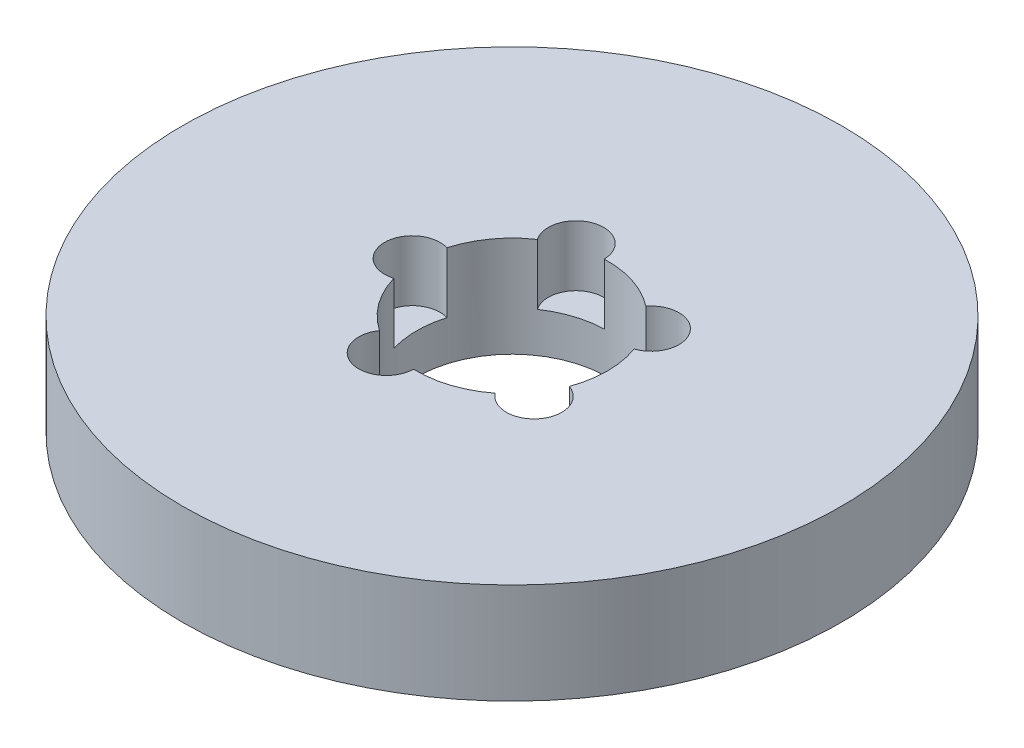
ISO-10303-21;
HEADER;
FILE_DESCRIPTION(('STEP AP214'),'2;1');
FILE_NAME('part.step','',(''),(''),'','','');
FILE_SCHEMA(('AUTOMOTIVE_DESIGN { 1 0 10303 214 1 1 1 1 }'));
ENDSEC;
DATA;
#1=APPLICATION_CONTEXT('core data for automotive mechanical design processes');
#2=APPLICATION_PROTOCOL_DEFINITION('international standard','automotive_design',2000,#1);
#3=PRODUCT_CONTEXT('',#1,'mechanical');
#4=PRODUCT('Part','Part','',(#3));
#5=PRODUCT_RELATED_PRODUCT_CATEGORY('part','',(#4));
#6=PRODUCT_DEFINITION_FORMATION('','',#4);
#7=PRODUCT_DEFINITION_CONTEXT('part definition',#1,'design');
#8=PRODUCT_DEFINITION('design','',#6,#7);
#9=PRODUCT_DEFINITION_SHAPE('','',#8);
#10=(LENGTH_UNIT() NAMED_UNIT(*) SI_UNIT(.MILLI.,.METRE.));
#11=(NAMED_UNIT(*) PLANE_ANGLE_UNIT() SI_UNIT($,.RADIAN.));
#12=(NAMED_UNIT(*) SI_UNIT($,.STERADIAN.) SOLID_ANGLE_UNIT());
#13=UNCERTAINTY_MEASURE_WITH_UNIT(LENGTH_MEASURE(1.E-05),#10,'distance_accuracy_value','');
#14=(GEOMETRIC_REPRESENTATION_CONTEXT(3) GLOBAL_UNCERTAINTY_ASSIGNED_CONTEXT((#13)) GLOBAL_UNIT_ASSIGNED_CONTEXT((#10,
#11,#12)) REPRESENTATION_CONTEXT('',''));
#15=CARTESIAN_POINT('',(0.,0.,0.));
#16=DIRECTION('',(0.,0.,1.));
#17=DIRECTION('',(1.,0.,0.));
#18=AXIS2_PLACEMENT_3D('',#15,#16,#17);
#19=CARTESIAN_POINT('',(0.,29.,0.));
#20=DIRECTION('',(0.,-1.,0.));
#21=DIRECTION('',(0.,0.,-1.));
#22=AXIS2_PLACEMENT_3D('',#19,#20,#21);
#23=CYLINDRICAL_SURFACE('',#22,95.);
#24=CARTESIAN_POINT('',(0.,29.,0.));
#25=DIRECTION('',(0.,1.,0.));
#26=DIRECTION('',(0.,0.,1.));
#27=AXIS2_PLACEMENT_3D('',#24,#25,#26);
#28=CIRCLE('',#27,95.);
#29=CARTESIAN_POINT('',(0.,29.,-95.));
#30=VERTEX_POINT('',#29);
#31=EDGE_CURVE('E157',#30,#30,#28,.T.);
#32=CARTESIAN_POINT('',(0.,0.,0.));
#33=DIRECTION('',(0.,1.,0.));
#34=DIRECTION('',(0.,0.,1.));
#35=AXIS2_PLACEMENT_3D('',#32,#33,#34);
#36=CIRCLE('',#35,95.);
#37=CARTESIAN_POINT('',(0.,0.,-95.));
#38=VERTEX_POINT('',#37);
#39=EDGE_CURVE('E150',#38,#38,#36,.T.);
#40=CARTESIAN_POINT('',(0.,29.,-95.));
#41=CARTESIAN_POINT('',(0.,28.6979166666667,-95.));
#42=CARTESIAN_POINT('',(0.,28.3958333333333,-95.));
#43=CARTESIAN_POINT('',(0.,27.7916666666667,-95.));
#44=CARTESIAN_POINT('',(0.,27.4895833333333,-95.));
#45=CARTESIAN_POINT('',(0.,26.8854166666667,-95.));
#46=CARTESIAN_POINT('',(0.,26.5833333333333,-95.));
#47=CARTESIAN_POINT('',(0.,25.9791666666667,-95.));
#48=CARTESIAN_POINT('',(0.,25.6770833333333,-95.));
#49=CARTESIAN_POINT('',(0.,25.0729166666667,-95.));
#50=CARTESIAN_POINT('',(0.,24.7708333333333,-95.));
#51=CARTESIAN_POINT('',(0.,24.1666666666667,-95.));
#52=CARTESIAN_POINT('',(0.,23.8645833333333,-95.));
#53=CARTESIAN_POINT('',(0.,23.2604166666667,-95.));
#54=CARTESIAN_POINT('',(0.,22.9583333333333,-95.));
#55=CARTESIAN_POINT('',(0.,22.3541666666667,-95.));
#56=CARTESIAN_POINT('',(0.,22.0520833333333,-95.));
#57=CARTESIAN_POINT('',(0.,21.4479166666667,-95.));
#58=CARTESIAN_POINT('',(0.,21.1458333333333,-95.));
#59=CARTESIAN_POINT('',(0.,20.5416666666667,-95.));
#60=CARTESIAN_POINT('',(0.,20.2395833333333,-95.));
#61=CARTESIAN_POINT('',(0.,19.6354166666667,-95.));
#62=CARTESIAN_POINT('',(0.,19.3333333333333,-95.));
#63=CARTESIAN_POINT('',(0.,18.7291666666667,-95.));
#64=CARTESIAN_POINT('',(0.,18.4270833333333,-95.));
#65=CARTESIAN_POINT('',(0.,17.8229166666667,-95.));
#66=CARTESIAN_POINT('',(0.,17.5208333333333,-95.));
#67=CARTESIAN_POINT('',(0.,16.9166666666667,-95.));
#68=CARTESIAN_POINT('',(0.,16.6145833333333,-95.));
#69=CARTESIAN_POINT('',(0.,16.0104166666667,-95.));
#70=CARTESIAN_POINT('',(0.,15.7083333333333,-95.));
#71=CARTESIAN_POINT('',(0.,15.1041666666667,-95.));
#72=CARTESIAN_POINT('',(0.,14.8020833333333,-95.));
#73=CARTESIAN_POINT('',(0.,14.1979166666667,-95.));
#74=CARTESIAN_POINT('',(0.,13.8958333333333,-95.));
#75=CARTESIAN_POINT('',(0.,13.2916666666667,-95.));
#76=CARTESIAN_POINT('',(0.,12.9895833333333,-95.));
#77=CARTESIAN_POINT('',(0.,12.3854166666667,-95.));
#78=CARTESIAN_POINT('',(0.,12.0833333333333,-95.));
#79=CARTESIAN_POINT('',(0.,11.4791666666667,-95.));
#80=CARTESIAN_POINT('',(0.,11.1770833333333,-95.));
#81=CARTESIAN_POINT('',(0.,10.5729166666667,-95.));
#82=CARTESIAN_POINT('',(0.,10.2708333333333,-95.));
#83=CARTESIAN_POINT('',(0.,9.66666666666667,-95.));
#84=CARTESIAN_POINT('',(0.,9.36458333333333,-95.));
#85=CARTESIAN_POINT('',(0.,8.76041666666667,-95.));
#86=CARTESIAN_POINT('',(0.,8.45833333333333,-95.));
#87=CARTESIAN_POINT('',(0.,7.85416666666667,-95.));
#88=CARTESIAN_POINT('',(0.,7.55208333333333,-95.));
#89=CARTESIAN_POINT('',(0.,6.94791666666667,-95.));
#90=CARTESIAN_POINT('',(0.,6.64583333333333,-95.));
#91=CARTESIAN_POINT('',(0.,6.04166666666667,-95.));
#92=CARTESIAN_POINT('',(0.,5.73958333333333,-95.));
#93=CARTESIAN_POINT('',(0.,5.13541666666667,-95.));
#94=CARTESIAN_POINT('',(0.,4.83333333333333,-95.));
#95=CARTESIAN_POINT('',(0.,4.22916666666667,-95.));
#96=CARTESIAN_POINT('',(0.,3.92708333333333,-95.));
#97=CARTESIAN_POINT('',(0.,3.32291666666667,-95.));
#98=CARTESIAN_POINT('',(0.,3.02083333333333,-95.));
#99=CARTESIAN_POINT('',(0.,2.41666666666667,-95.));
#100=CARTESIAN_POINT('',(0.,2.11458333333333,-95.));
#101=CARTESIAN_POINT('',(0.,1.51041666666667,-95.));
#102=CARTESIAN_POINT('',(0.,1.20833333333333,-95.));
#103=CARTESIAN_POINT('',(0.,0.604166666666667,-95.));
#104=CARTESIAN_POINT('',(0.,0.302083333333333,-95.));
#105=CARTESIAN_POINT('',(0.,0.,-95.));
#106=B_SPLINE_CURVE_WITH_KNOTS('',3,(#40,#41,#42,#43,#44,#45,#46,#47,#48,#49,#50,#51,#52,#53,
#54,#55,#56,#57,#58,#59,#60,#61,#62,#63,#64,#65,#66,#67,#68,#69,#70,#71,#72,#73,#74,#75,#76,#77,
#78,#79,#80,#81,#82,#83,#84,#85,#86,#87,#88,#89,#90,#91,#92,#93,#94,#95,#96,#97,#98,#99,#100,
#101,#102,#103,#104,#105),.UNSPECIFIED.,.F.,.F.,(4,2,2,2,2,2,2,2,2,2,2,2,2,2,2,2,2,2,2,2,2,2,2,
2,2,2,2,2,2,2,2,2,4),(0.,0.906249999999997,1.8125,2.71875,3.625,4.53125,5.4375,6.34375,7.25,
8.15625,9.0625,9.96875,10.875,11.78125,12.6875,13.59375,14.5,15.40625,16.3125,17.21875,18.125,
19.03125,19.9375,20.84375,21.75,22.65625,23.5625,24.46875,25.375,26.28125,27.1875,28.09375,29.),.UNSPECIFIED.);
#107=EDGE_CURVE('BSEAM39',#30,#38,#106,.T.);
#108=ORIENTED_EDGE('',*,*,#31,.F.);
#109=ORIENTED_EDGE('',*,*,#39,.T.);
#110=ORIENTED_EDGE('',*,*,#107,.T.);
#111=ORIENTED_EDGE('',*,*,#107,.F.);
#112=EDGE_LOOP('',(#108,#110,#109,#111));
#113=FACE_BOUND('',#112,.T.);
#114=ADVANCED_FACE('F39',(#113),#23,.T.);
#115=CARTESIAN_POINT('',(0.,29.,0.));
#116=DIRECTION('',(0.,1.,0.));
#117=DIRECTION('',(0.,0.,1.));
#118=AXIS2_PLACEMENT_3D('',#115,#116,#117);
#119=PLANE('',#118);
#120=CARTESIAN_POINT('',(-8.88118562941379,29.,-27.3334788022432));
#121=DIRECTION('',(0.,1.,0.));
#122=DIRECTION('',(-0.95105651629515,0.,0.309016994374958));
#123=AXIS2_PLACEMENT_3D('',#120,#121,#122);
#124=CIRCLE('',#123,7.99023679915779);
#125=CARTESIAN_POINT('',(-0.892395447374492,29.,-27.4855167381933));
#126=VERTEX_POINT('',#125);
#127=CARTESIAN_POINT('',(-15.4336183077197,29.,-22.7607870235548));
#128=VERTEX_POINT('',#127);
#129=EDGE_CURVE('E194',#126,#128,#124,.T.);
#130=ORIENTED_EDGE('',*,*,#129,.F.);
#131=CARTESIAN_POINT('',(0.,29.,0.));
#132=DIRECTION('',(0.,1.,0.));
#133=DIRECTION('',(0.,0.,1.));
#134=AXIS2_PLACEMENT_3D('',#131,#132,#133);
#135=CIRCLE('',#134,27.5);
#136=CARTESIAN_POINT('',(16.8775444729763,29.,-21.7117132571961));
#137=VERTEX_POINT('',#136);
#138=EDGE_CURVE('E147',#137,#126,#135,.T.);
#139=ORIENTED_EDGE('',*,*,#138,.F.);
#140=CARTESIAN_POINT('',(23.2512458382015,29.,-16.8930189305613));
#141=DIRECTION('',(0.,1.,0.));
#142=DIRECTION('',(-0.58778525229248,0.,-0.809016994374942));
#143=AXIS2_PLACEMENT_3D('',#140,#141,#142);
#144=CIRCLE('',#143,7.99023679915779);
#145=CARTESIAN_POINT('',(25.8645144386567,29.,-9.34221027661638));
#146=VERTEX_POINT('',#145);
#147=EDGE_CURVE('E254',#146,#137,#144,.T.);
#148=ORIENTED_EDGE('',*,*,#147,.F.);
#149=CARTESIAN_POINT('',(25.8645144386569,29.,9.34221027661601));
#150=VERTEX_POINT('',#149);
#151=EDGE_CURVE('E144',#150,#146,#135,.T.);
#152=ORIENTED_EDGE('',*,*,#151,.F.);
#153=CARTESIAN_POINT('',(23.2512458382017,29.,16.893018930561));
#154=DIRECTION('',(0.,1.,0.));
#155=DIRECTION('',(0.587785252292469,0.,-0.809016994374951));
#156=AXIS2_PLACEMENT_3D('',#153,#154,#155);
#157=CIRCLE('',#156,7.99023679915779);
#158=CARTESIAN_POINT('',(16.8775444729766,29.,21.7117132571959));
#159=VERTEX_POINT('',#158);
#160=EDGE_CURVE('E141',#159,#150,#157,.T.);
#161=ORIENTED_EDGE('',*,*,#160,.F.);
#162=CARTESIAN_POINT('',(-0.892395447374104,29.,27.4855167381933));
#163=VERTEX_POINT('',#162);
#164=EDGE_CURVE('E134',#163,#159,#135,.T.);
#165=ORIENTED_EDGE('',*,*,#164,.F.);
#166=CARTESIAN_POINT('',(-8.8811856294134,29.,27.3334788022433));
#167=DIRECTION('',(0.,1.,0.));
#168=DIRECTION('',(0.951056516295155,0.,0.309016994374945));
#169=AXIS2_PLACEMENT_3D('',#166,#167,#168);
#170=CIRCLE('',#169,7.99023679915779);
#171=CARTESIAN_POINT('',(-15.4336183077193,29.,22.760787023555));
#172=VERTEX_POINT('',#171);
#173=EDGE_CURVE('E111',#172,#163,#170,.T.);
#174=ORIENTED_EDGE('',*,*,#173,.F.);
#175=CARTESIAN_POINT('',(-26.4160451565397,29.,7.64477326594147));
#176=VERTEX_POINT('',#175);
#177=EDGE_CURVE('E145',#176,#172,#135,.T.);
#178=ORIENTED_EDGE('',*,*,#177,.F.);
#179=CARTESIAN_POINT('',(-28.7401204175763,29.,0.));
#180=DIRECTION('',(0.,1.,0.));
#181=DIRECTION('',(0.,0.,1.));
#182=AXIS2_PLACEMENT_3D('',#179,#180,#181);
#183=CIRCLE('',#182,7.99023679915779);
#184=CARTESIAN_POINT('',(-26.4160451565397,29.,-7.64477326594147));
#185=VERTEX_POINT('',#184);
#186=EDGE_CURVE('E153',#185,#176,#183,.T.);
#187=ORIENTED_EDGE('',*,*,#186,.F.);
#188=EDGE_CURVE('E146',#128,#185,#135,.T.);
#189=ORIENTED_EDGE('',*,*,#188,.F.);
#190=EDGE_LOOP('',(#130,#139,#148,#152,#161,#165,#174,#178,#187,#189));
#191=FACE_BOUND('',#190,.T.);
#192=ORIENTED_EDGE('',*,*,#31,.T.);
#193=EDGE_LOOP('',(#192));
#194=FACE_BOUND('',#193,.T.);
#195=ADVANCED_FACE('F139',(#191,#194),#119,.T.);
#196=CARTESIAN_POINT('',(0.,0.,0.));
#197=DIRECTION('',(0.,1.,0.));
#198=DIRECTION('',(0.,0.,1.));
#199=AXIS2_PLACEMENT_3D('',#196,#197,#198);
#200=PLANE('',#199);
#201=CARTESIAN_POINT('',(0.,0.,0.));
#202=DIRECTION('',(0.,1.,0.));
#203=DIRECTION('',(0.,0.,1.));
#204=AXIS2_PLACEMENT_3D('',#201,#202,#203);
#205=CIRCLE('',#204,27.5);
#206=CARTESIAN_POINT('',(0.,0.,27.5));
#207=VERTEX_POINT('',#206);
#208=EDGE_CURVE('E154',#207,#207,#205,.T.);
#209=ORIENTED_EDGE('',*,*,#208,.T.);
#210=EDGE_LOOP('',(#209));
#211=FACE_BOUND('',#210,.T.);
#212=ORIENTED_EDGE('',*,*,#39,.F.);
#213=EDGE_LOOP('',(#212));
#214=FACE_BOUND('',#213,.T.);
#215=ADVANCED_FACE('F213',(#211,#214),#200,.F.);
#216=CARTESIAN_POINT('',(0.,29.,0.));
#217=DIRECTION('',(0.,-1.,0.));
#218=DIRECTION('',(0.,0.,-1.));
#219=AXIS2_PLACEMENT_3D('',#216,#217,#218);
#220=CYLINDRICAL_SURFACE('',#219,27.5);
#221=DIRECTION('',(0.,1.,0.));
#222=VECTOR('',#221,1.);
#223=CARTESIAN_POINT('',(-0.892395447374494,20.2711361422768,-27.4855167381933));
#224=LINE('',#223,#222);
#225=CARTESIAN_POINT('',(-0.892395447374492,11.5422722845536,-27.4855167381933));
#226=VERTEX_POINT('',#225);
#227=EDGE_CURVE('E11',#226,#126,#224,.T.);
#228=ORIENTED_EDGE('',*,*,#227,.F.);
#229=CARTESIAN_POINT('',(0.,11.5422722845536,0.));
#230=DIRECTION('',(0.,1.,0.));
#231=DIRECTION('',(0.,0.,1.));
#232=AXIS2_PLACEMENT_3D('',#229,#230,#231);
#233=CIRCLE('',#232,27.5);
#234=CARTESIAN_POINT('',(-15.4336183077197,11.5422722845536,-22.7607870235548));
#235=VERTEX_POINT('',#234);
#236=EDGE_CURVE('E189',#226,#235,#233,.T.);
#237=ORIENTED_EDGE('',*,*,#236,.T.);
#238=DIRECTION('',(0.,1.,0.));
#239=VECTOR('',#238,1.);
#240=CARTESIAN_POINT('',(-15.4336183077197,20.2711361422768,-22.7607870235548));
#241=LINE('',#240,#239);
#242=EDGE_CURVE('E46',#128,#235,#241,.F.);
#243=ORIENTED_EDGE('',*,*,#242,.F.);
#244=ORIENTED_EDGE('',*,*,#188,.T.);
#245=DIRECTION('',(0.,1.,0.));
#246=VECTOR('',#245,1.);
#247=CARTESIAN_POINT('',(-26.4160451565397,20.2711361422768,-7.64477326594147));
#248=LINE('',#247,#246);
#249=CARTESIAN_POINT('',(-26.4160451565397,11.5422722845536,-7.64477326594147));
#250=VERTEX_POINT('',#249);
#251=EDGE_CURVE('E168',#250,#185,#248,.T.);
#252=ORIENTED_EDGE('',*,*,#251,.F.);
#253=CARTESIAN_POINT('',(0.,11.5422722845536,0.));
#254=DIRECTION('',(0.,1.,0.));
#255=DIRECTION('',(0.,0.,1.));
#256=AXIS2_PLACEMENT_3D('',#253,#254,#255);
#257=CIRCLE('',#256,27.5);
#258=CARTESIAN_POINT('',(-26.4160451565397,11.5422722845536,7.64477326594147));
#259=VERTEX_POINT('',#258);
#260=EDGE_CURVE('E165',#250,#259,#257,.T.);
#261=ORIENTED_EDGE('',*,*,#260,.T.);
#262=DIRECTION('',(0.,1.,0.));
#263=VECTOR('',#262,1.);
#264=CARTESIAN_POINT('',(-26.4160451565397,20.2711361422768,7.64477326594147));
#265=LINE('',#264,#263);
#266=EDGE_CURVE('E170',#176,#259,#265,.F.);
#267=ORIENTED_EDGE('',*,*,#266,.F.);
#268=ORIENTED_EDGE('',*,*,#177,.T.);
#269=DIRECTION('',(0.,1.,0.));
#270=VECTOR('',#269,1.);
#271=CARTESIAN_POINT('',(-15.4336183077193,20.2711361422768,22.760787023555));
#272=LINE('',#271,#270);
#273=CARTESIAN_POINT('',(-15.4336183077193,11.5422722845536,22.760787023555));
#274=VERTEX_POINT('',#273);
#275=EDGE_CURVE('E121',#274,#172,#272,.T.);
#276=ORIENTED_EDGE('',*,*,#275,.F.);
#277=CARTESIAN_POINT('',(0.,11.5422722845536,0.));
#278=DIRECTION('',(0.,1.,0.));
#279=DIRECTION('',(0.,0.,1.));
#280=AXIS2_PLACEMENT_3D('',#277,#278,#279);
#281=CIRCLE('',#280,27.5);
#282=CARTESIAN_POINT('',(-0.892395447374104,11.5422722845536,27.4855167381933));
#283=VERTEX_POINT('',#282);
#284=EDGE_CURVE('E136',#274,#283,#281,.T.);
#285=ORIENTED_EDGE('',*,*,#284,.T.);
#286=DIRECTION('',(0.,1.,0.));
#287=VECTOR('',#286,1.);
#288=CARTESIAN_POINT('',(-0.892395447374104,20.2711361422768,27.4855167381933));
#289=LINE('',#288,#287);
#290=EDGE_CURVE('E117',#163,#283,#289,.F.);
#291=ORIENTED_EDGE('',*,*,#290,.F.);
#292=ORIENTED_EDGE('',*,*,#164,.T.);
#293=DIRECTION('',(0.,1.,0.));
#294=VECTOR('',#293,1.);
#295=CARTESIAN_POINT('',(16.8775444729766,20.2711361422768,21.7117132571959));
#296=LINE('',#295,#294);
#297=CARTESIAN_POINT('',(16.8775444729766,11.5422722845536,21.7117132571959));
#298=VERTEX_POINT('',#297);
#299=EDGE_CURVE('E182',#298,#159,#296,.T.);
#300=ORIENTED_EDGE('',*,*,#299,.F.);
#301=CARTESIAN_POINT('',(0.,11.5422722845536,0.));
#302=DIRECTION('',(0.,1.,0.));
#303=DIRECTION('',(0.,0.,1.));
#304=AXIS2_PLACEMENT_3D('',#301,#302,#303);
#305=CIRCLE('',#304,27.5);
#306=CARTESIAN_POINT('',(25.8645144386569,11.5422722845536,9.34221027661601));
#307=VERTEX_POINT('',#306);
#308=EDGE_CURVE('E174',#298,#307,#305,.T.);
#309=ORIENTED_EDGE('',*,*,#308,.T.);
#310=DIRECTION('',(0.,1.,0.));
#311=VECTOR('',#310,1.);
#312=CARTESIAN_POINT('',(25.8645144386569,20.2711361422768,9.34221027661601));
#313=LINE('',#312,#311);
#314=EDGE_CURVE('E177',#150,#307,#313,.F.);
#315=ORIENTED_EDGE('',*,*,#314,.F.);
#316=ORIENTED_EDGE('',*,*,#151,.T.);
#317=DIRECTION('',(0.,1.,0.));
#318=VECTOR('',#317,1.);
#319=CARTESIAN_POINT('',(25.8645144386567,20.2711361422768,-9.34221027661638));
#320=LINE('',#319,#318);
#321=CARTESIAN_POINT('',(25.8645144386567,11.5422722845536,-9.34221027661638));
#322=VERTEX_POINT('',#321);
#323=EDGE_CURVE('E187',#322,#146,#320,.T.);
#324=ORIENTED_EDGE('',*,*,#323,.F.);
#325=CARTESIAN_POINT('',(0.,11.5422722845536,0.));
#326=DIRECTION('',(0.,1.,0.));
#327=DIRECTION('',(0.,0.,1.));
#328=AXIS2_PLACEMENT_3D('',#325,#326,#327);
#329=CIRCLE('',#328,27.5);
#330=CARTESIAN_POINT('',(16.8775444729763,11.5422722845536,-21.7117132571961));
#331=VERTEX_POINT('',#330);
#332=EDGE_CURVE('E181',#322,#331,#329,.T.);
#333=ORIENTED_EDGE('',*,*,#332,.T.);
#334=DIRECTION('',(0.,1.,0.));
#335=VECTOR('',#334,1.);
#336=CARTESIAN_POINT('',(16.8775444729763,20.2711361422768,-21.7117132571961));
#337=LINE('',#336,#335);
#338=EDGE_CURVE('E186',#137,#331,#337,.F.);
#339=ORIENTED_EDGE('',*,*,#338,.F.);
#340=ORIENTED_EDGE('',*,*,#138,.T.);
#341=EDGE_LOOP('',(#228,#237,#243,#244,#252,#261,#267,#268,#276,#285,#291,#292,#300,#309,#315,
#316,#324,#333,#339,#340));
#342=FACE_BOUND('',#341,.T.);
#343=ORIENTED_EDGE('',*,*,#208,.F.);
#344=EDGE_LOOP('',(#343));
#345=FACE_BOUND('',#344,.T.);
#346=ADVANCED_FACE('F135',(#342,#345),#220,.F.);
#347=CARTESIAN_POINT('',(-28.7401204175763,11.5422722845536,0.));
#348=DIRECTION('',(0.,1.,0.));
#349=DIRECTION('',(0.,0.,1.));
#350=AXIS2_PLACEMENT_3D('',#347,#348,#349);
#351=CYLINDRICAL_SURFACE('',#350,7.99023679915779);
#352=ORIENTED_EDGE('',*,*,#251,.T.);
#353=ORIENTED_EDGE('',*,*,#186,.T.);
#354=ORIENTED_EDGE('',*,*,#266,.T.);
#355=CARTESIAN_POINT('',(-28.7401204175763,11.5422722845536,0.));
#356=DIRECTION('',(0.,1.,0.));
#357=DIRECTION('',(0.,0.,1.));
#358=AXIS2_PLACEMENT_3D('',#355,#356,#357);
#359=CIRCLE('',#358,7.99023679915779);
#360=EDGE_CURVE('E158',#250,#259,#359,.T.);
#361=ORIENTED_EDGE('',*,*,#360,.F.);
#362=EDGE_LOOP('',(#352,#353,#354,#361));
#363=FACE_BOUND('',#362,.T.);
#364=ADVANCED_FACE('F221',(#363),#351,.F.);
#365=CARTESIAN_POINT('',(-28.7401204175763,11.5422722845536,0.));
#366=DIRECTION('',(0.,1.,0.));
#367=DIRECTION('',(0.,0.,1.));
#368=AXIS2_PLACEMENT_3D('',#365,#366,#367);
#369=PLANE('',#368);
#370=ORIENTED_EDGE('',*,*,#360,.T.);
#371=ORIENTED_EDGE('',*,*,#260,.F.);
#372=EDGE_LOOP('',(#370,#371));
#373=FACE_BOUND('',#372,.T.);
#374=ADVANCED_FACE('F227',(#373),#369,.T.);
#375=CARTESIAN_POINT('',(-8.8811856294134,11.5422722845536,27.3334788022433));
#376=DIRECTION('',(0.,1.,0.));
#377=DIRECTION('',(0.,0.,1.));
#378=AXIS2_PLACEMENT_3D('',#375,#376,#377);
#379=CYLINDRICAL_SURFACE('',#378,7.99023679915779);
#380=ORIENTED_EDGE('',*,*,#275,.T.);
#381=ORIENTED_EDGE('',*,*,#173,.T.);
#382=ORIENTED_EDGE('',*,*,#290,.T.);
#383=CARTESIAN_POINT('',(-8.8811856294134,11.5422722845536,27.3334788022433));
#384=DIRECTION('',(0.,1.,0.));
#385=DIRECTION('',(0.951056516295155,0.,0.309016994374945));
#386=AXIS2_PLACEMENT_3D('',#383,#384,#385);
#387=CIRCLE('',#386,7.99023679915779);
#388=EDGE_CURVE('E127',#274,#283,#387,.T.);
#389=ORIENTED_EDGE('',*,*,#388,.F.);
#390=EDGE_LOOP('',(#380,#381,#382,#389));
#391=FACE_BOUND('',#390,.T.);
#392=ADVANCED_FACE('F116',(#391),#379,.F.);
#393=CARTESIAN_POINT('',(-8.8811856294134,11.5422722845536,27.3334788022433));
#394=DIRECTION('',(0.,1.,0.));
#395=DIRECTION('',(0.951056516295155,0.,0.309016994374945));
#396=AXIS2_PLACEMENT_3D('',#393,#394,#395);
#397=PLANE('',#396);
#398=ORIENTED_EDGE('',*,*,#388,.T.);
#399=ORIENTED_EDGE('',*,*,#284,.F.);
#400=EDGE_LOOP('',(#398,#399));
#401=FACE_BOUND('',#400,.T.);
#402=ADVANCED_FACE('F234',(#401),#397,.T.);
#403=CARTESIAN_POINT('',(23.2512458382017,11.5422722845536,16.893018930561));
#404=DIRECTION('',(0.,1.,0.));
#405=DIRECTION('',(0.,0.,1.));
#406=AXIS2_PLACEMENT_3D('',#403,#404,#405);
#407=CYLINDRICAL_SURFACE('',#406,7.99023679915779);
#408=ORIENTED_EDGE('',*,*,#299,.T.);
#409=ORIENTED_EDGE('',*,*,#160,.T.);
#410=ORIENTED_EDGE('',*,*,#314,.T.);
#411=CARTESIAN_POINT('',(23.2512458382017,11.5422722845536,16.893018930561));
#412=DIRECTION('',(0.,1.,0.));
#413=DIRECTION('',(0.587785252292469,0.,-0.809016994374951));
#414=AXIS2_PLACEMENT_3D('',#411,#412,#413);
#415=CIRCLE('',#414,7.99023679915779);
#416=EDGE_CURVE('E130',#298,#307,#415,.T.);
#417=ORIENTED_EDGE('',*,*,#416,.F.);
#418=EDGE_LOOP('',(#408,#409,#410,#417));
#419=FACE_BOUND('',#418,.T.);
#420=ADVANCED_FACE('F240',(#419),#407,.F.);
#421=CARTESIAN_POINT('',(23.2512458382017,11.5422722845536,16.893018930561));
#422=DIRECTION('',(0.,1.,0.));
#423=DIRECTION('',(0.587785252292469,0.,-0.809016994374951));
#424=AXIS2_PLACEMENT_3D('',#421,#422,#423);
#425=PLANE('',#424);
#426=ORIENTED_EDGE('',*,*,#416,.T.);
#427=ORIENTED_EDGE('',*,*,#308,.F.);
#428=EDGE_LOOP('',(#426,#427));
#429=FACE_BOUND('',#428,.T.);
#430=ADVANCED_FACE('F245',(#429),#425,.T.);
#431=CARTESIAN_POINT('',(23.2512458382015,11.5422722845536,-16.8930189305613));
#432=DIRECTION('',(0.,1.,0.));
#433=DIRECTION('',(0.,0.,1.));
#434=AXIS2_PLACEMENT_3D('',#431,#432,#433);
#435=CYLINDRICAL_SURFACE('',#434,7.99023679915779);
#436=ORIENTED_EDGE('',*,*,#323,.T.);
#437=ORIENTED_EDGE('',*,*,#147,.T.);
#438=ORIENTED_EDGE('',*,*,#338,.T.);
#439=CARTESIAN_POINT('',(23.2512458382015,11.5422722845536,-16.8930189305613));
#440=DIRECTION('',(0.,1.,0.));
#441=DIRECTION('',(-0.58778525229248,0.,-0.809016994374942));
#442=AXIS2_PLACEMENT_3D('',#439,#440,#441);
#443=CIRCLE('',#442,7.99023679915779);
#444=EDGE_CURVE('E56',#322,#331,#443,.T.);
#445=ORIENTED_EDGE('',*,*,#444,.F.);
#446=EDGE_LOOP('',(#436,#437,#438,#445));
#447=FACE_BOUND('',#446,.T.);
#448=ADVANCED_FACE('F266',(#447),#435,.F.);
#449=CARTESIAN_POINT('',(23.2512458382015,11.5422722845536,-16.8930189305613));
#450=DIRECTION('',(0.,1.,0.));
#451=DIRECTION('',(-0.58778525229248,0.,-0.809016994374942));
#452=AXIS2_PLACEMENT_3D('',#449,#450,#451);
#453=PLANE('',#452);
#454=ORIENTED_EDGE('',*,*,#444,.T.);
#455=ORIENTED_EDGE('',*,*,#332,.F.);
#456=EDGE_LOOP('',(#454,#455));
#457=FACE_BOUND('',#456,.T.);
#458=ADVANCED_FACE('F204',(#457),#453,.T.);
#459=CARTESIAN_POINT('',(-8.88118562941379,11.5422722845536,-27.3334788022432));
#460=DIRECTION('',(0.,1.,0.));
#461=DIRECTION('',(0.,0.,1.));
#462=AXIS2_PLACEMENT_3D('',#459,#460,#461);
#463=CYLINDRICAL_SURFACE('',#462,7.99023679915779);
#464=ORIENTED_EDGE('',*,*,#227,.T.);
#465=ORIENTED_EDGE('',*,*,#129,.T.);
#466=ORIENTED_EDGE('',*,*,#242,.T.);
#467=CARTESIAN_POINT('',(-8.88118562941379,11.5422722845536,-27.3334788022432));
#468=DIRECTION('',(0.,1.,0.));
#469=DIRECTION('',(-0.95105651629515,0.,0.309016994374958));
#470=AXIS2_PLACEMENT_3D('',#467,#468,#469);
#471=CIRCLE('',#470,7.99023679915779);
#472=EDGE_CURVE('E55',#226,#235,#471,.T.);
#473=ORIENTED_EDGE('',*,*,#472,.F.);
#474=EDGE_LOOP('',(#464,#465,#466,#473));
#475=FACE_BOUND('',#474,.T.);
#476=ADVANCED_FACE('F193',(#475),#463,.F.);
#477=CARTESIAN_POINT('',(-8.88118562941379,11.5422722845536,-27.3334788022432));
#478=DIRECTION('',(0.,1.,0.));
#479=DIRECTION('',(-0.95105651629515,0.,0.309016994374958));
#480=AXIS2_PLACEMENT_3D('',#477,#478,#479);
#481=PLANE('',#480);
#482=ORIENTED_EDGE('',*,*,#472,.T.);
#483=ORIENTED_EDGE('',*,*,#236,.F.);
#484=EDGE_LOOP('',(#482,#483));
#485=FACE_BOUND('',#484,.T.);
#486=ADVANCED_FACE('F196',(#485),#481,.T.);
#487=CLOSED_SHELL('',(#114,#195,#215,#346,#364,#374,#392,#402,#420,#430,#448,#458,#476,#486));
#488=MANIFOLD_SOLID_BREP('B2',#487);
#489=ADVANCED_BREP_SHAPE_REPRESENTATION('',(#18,#488),#14);
#490=SHAPE_DEFINITION_REPRESENTATION(#9,#489);
ENDSEC;
END-ISO-10303-21;
